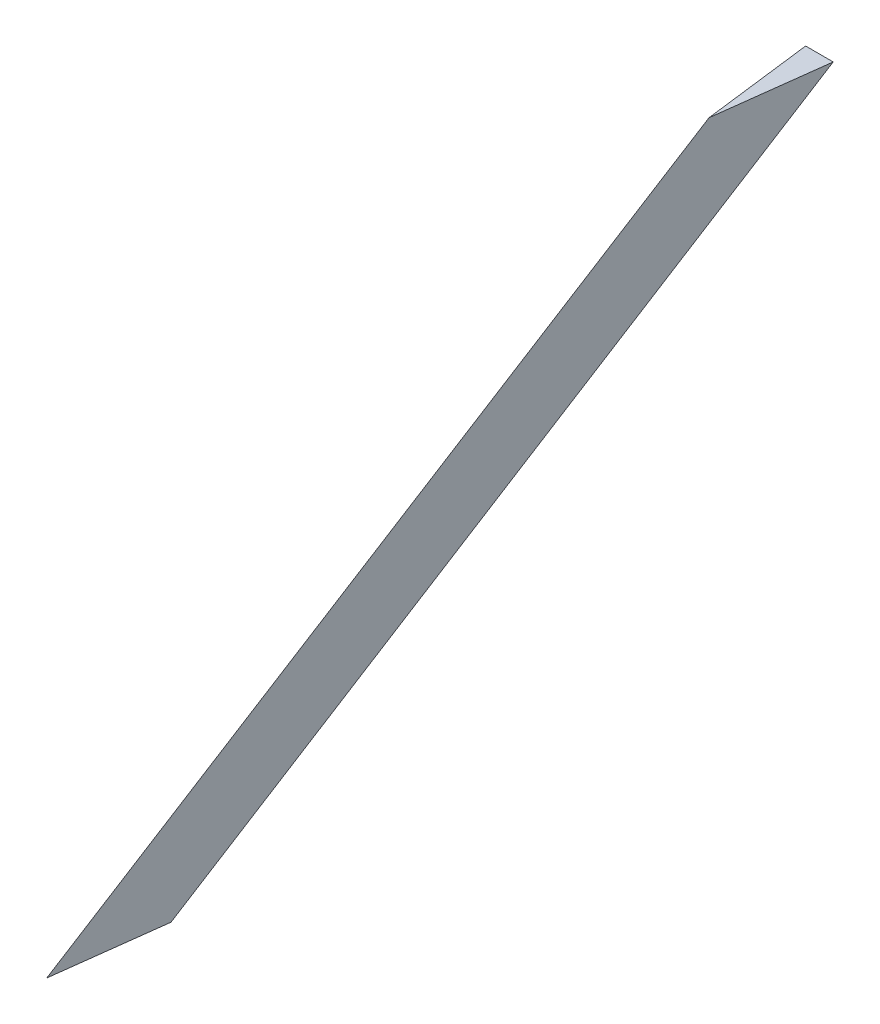
ISO-10303-21;
HEADER;
FILE_DESCRIPTION(('STEP AP214'),'2;1');
FILE_NAME('part.step','',(''),(''),'','','');
FILE_SCHEMA(('AUTOMOTIVE_DESIGN { 1 0 10303 214 1 1 1 1 }'));
ENDSEC;
DATA;
#1=APPLICATION_CONTEXT('core data for automotive mechanical design processes');
#2=APPLICATION_PROTOCOL_DEFINITION('international standard','automotive_design',2000,#1);
#3=PRODUCT_CONTEXT('',#1,'mechanical');
#4=PRODUCT('Part','Part','',(#3));
#5=PRODUCT_RELATED_PRODUCT_CATEGORY('part','',(#4));
#6=PRODUCT_DEFINITION_FORMATION('','',#4);
#7=PRODUCT_DEFINITION_CONTEXT('part definition',#1,'design');
#8=PRODUCT_DEFINITION('design','',#6,#7);
#9=PRODUCT_DEFINITION_SHAPE('','',#8);
#10=(LENGTH_UNIT() NAMED_UNIT(*) SI_UNIT(.MILLI.,.METRE.));
#11=(NAMED_UNIT(*) PLANE_ANGLE_UNIT() SI_UNIT($,.RADIAN.));
#12=(NAMED_UNIT(*) SI_UNIT($,.STERADIAN.) SOLID_ANGLE_UNIT());
#13=UNCERTAINTY_MEASURE_WITH_UNIT(LENGTH_MEASURE(1.E-05),#10,'distance_accuracy_value','');
#14=(GEOMETRIC_REPRESENTATION_CONTEXT(3) GLOBAL_UNCERTAINTY_ASSIGNED_CONTEXT((#13)) GLOBAL_UNIT_ASSIGNED_CONTEXT((#10,
#11,#12)) REPRESENTATION_CONTEXT('',''));
#15=CARTESIAN_POINT('',(0.,0.,0.));
#16=DIRECTION('',(0.,0.,1.));
#17=DIRECTION('',(1.,0.,0.));
#18=AXIS2_PLACEMENT_3D('',#15,#16,#17);
#19=CARTESIAN_POINT('',(0.,0.,0.));
#20=DIRECTION('',(0.,1.,0.));
#21=DIRECTION('',(0.,0.,1.));
#22=AXIS2_PLACEMENT_3D('',#19,#20,#21);
#23=PLANE('',#22);
#24=DIRECTION('',(0.124034734589208,0.,-0.992277876713668));
#25=VECTOR('',#24,1.);
#26=CARTESIAN_POINT('',(3.175,0.,0.));
#27=LINE('',#26,#25);
#28=CARTESIAN_POINT('',(0.,0.,25.4));
#29=VERTEX_POINT('',#28);
#30=CARTESIAN_POINT('',(3.175,0.,0.));
#31=VERTEX_POINT('',#30);
#32=EDGE_CURVE('E64',#29,#31,#27,.T.);
#33=ORIENTED_EDGE('',*,*,#32,.F.);
#34=DIRECTION('',(0.124034734589208,0.,0.992277876713668));
#35=VECTOR('',#34,1.);
#36=CARTESIAN_POINT('',(0.,0.,25.4));
#37=LINE('',#36,#35);
#38=CARTESIAN_POINT('',(-3.175,0.,0.));
#39=VERTEX_POINT('',#38);
#40=EDGE_CURVE('E67',#39,#29,#37,.T.);
#41=ORIENTED_EDGE('',*,*,#40,.F.);
#42=DIRECTION('',(-1.,0.,0.));
#43=VECTOR('',#42,1.);
#44=CARTESIAN_POINT('',(-3.175,0.,0.));
#45=LINE('',#44,#43);
#46=EDGE_CURVE('E61',#31,#39,#45,.T.);
#47=ORIENTED_EDGE('',*,*,#46,.F.);
#48=EDGE_LOOP('',(#33,#41,#47));
#49=FACE_BOUND('',#48,.T.);
#50=ADVANCED_FACE('F33',(#49),#23,.F.);
#51=CARTESIAN_POINT('',(0.,95.25,-152.4));
#52=DIRECTION('',(0.,1.,0.));
#53=DIRECTION('',(0.,0.,1.));
#54=AXIS2_PLACEMENT_3D('',#51,#52,#53);
#55=PLANE('',#54);
#56=DIRECTION('',(0.124034734589208,0.,-0.992277876713668));
#57=VECTOR('',#56,1.);
#58=CARTESIAN_POINT('',(3.175,95.25,-152.4));
#59=LINE('',#58,#57);
#60=CARTESIAN_POINT('',(0.,95.25,-127.));
#61=VERTEX_POINT('',#60);
#62=CARTESIAN_POINT('',(3.175,95.25,-152.4));
#63=VERTEX_POINT('',#62);
#64=EDGE_CURVE('E46',#61,#63,#59,.T.);
#65=ORIENTED_EDGE('',*,*,#64,.T.);
#66=DIRECTION('',(-1.,0.,0.));
#67=VECTOR('',#66,1.);
#68=CARTESIAN_POINT('',(-3.175,95.25,-152.4));
#69=LINE('',#68,#67);
#70=CARTESIAN_POINT('',(-3.175,95.25,-152.4));
#71=VERTEX_POINT('',#70);
#72=EDGE_CURVE('E11',#63,#71,#69,.T.);
#73=ORIENTED_EDGE('',*,*,#72,.T.);
#74=DIRECTION('',(0.124034734589208,0.,0.992277876713668));
#75=VECTOR('',#74,1.);
#76=CARTESIAN_POINT('',(0.,95.25,-127.));
#77=LINE('',#76,#75);
#78=EDGE_CURVE('E51',#71,#61,#77,.T.);
#79=ORIENTED_EDGE('',*,*,#78,.T.);
#80=EDGE_LOOP('',(#65,#73,#79));
#81=FACE_BOUND('',#80,.T.);
#82=ADVANCED_FACE('F96',(#81),#55,.T.);
#83=CARTESIAN_POINT('',(0.,0.,25.4));
#84=DIRECTION('',(-0.973296510978544,0.194659302195709,0.121662063872318));
#85=DIRECTION('',(-0.196116135138184,-0.98058067569092,0.));
#86=AXIS2_PLACEMENT_3D('',#83,#84,#85);
#87=PLANE('',#86);
#88=DIRECTION('',(0.,0.52999894000318,-0.847998304005088));
#89=VECTOR('',#88,1.);
#90=CARTESIAN_POINT('',(0.,0.,25.4));
#91=LINE('',#90,#89);
#92=EDGE_CURVE('E81',#29,#61,#91,.T.);
#93=ORIENTED_EDGE('',*,*,#92,.T.);
#94=ORIENTED_EDGE('',*,*,#78,.F.);
#95=DIRECTION('',(0.,0.52999894000318,-0.847998304005088));
#96=VECTOR('',#95,1.);
#97=CARTESIAN_POINT('',(-3.175,0.,0.));
#98=LINE('',#97,#96);
#99=EDGE_CURVE('E77',#39,#71,#98,.T.);
#100=ORIENTED_EDGE('',*,*,#99,.F.);
#101=ORIENTED_EDGE('',*,*,#40,.T.);
#102=EDGE_LOOP('',(#93,#94,#100,#101));
#103=FACE_BOUND('',#102,.T.);
#104=ADVANCED_FACE('F79',(#103),#87,.T.);
#105=CARTESIAN_POINT('',(3.175,0.,0.));
#106=DIRECTION('',(0.973296510978544,0.194659302195709,0.121662063872318));
#107=DIRECTION('',(-0.196116135138184,0.98058067569092,0.));
#108=AXIS2_PLACEMENT_3D('',#105,#106,#107);
#109=PLANE('',#108);
#110=DIRECTION('',(0.,0.52999894000318,-0.847998304005088));
#111=VECTOR('',#110,1.);
#112=CARTESIAN_POINT('',(3.175,0.,0.));
#113=LINE('',#112,#111);
#114=EDGE_CURVE('E40',#31,#63,#113,.T.);
#115=ORIENTED_EDGE('',*,*,#114,.T.);
#116=ORIENTED_EDGE('',*,*,#64,.F.);
#117=ORIENTED_EDGE('',*,*,#92,.F.);
#118=ORIENTED_EDGE('',*,*,#32,.T.);
#119=EDGE_LOOP('',(#115,#116,#117,#118));
#120=FACE_BOUND('',#119,.T.);
#121=ADVANCED_FACE('F88',(#120),#109,.T.);
#122=CARTESIAN_POINT('',(-3.175,0.,0.));
#123=DIRECTION('',(0.,-0.847998304005088,-0.52999894000318));
#124=DIRECTION('',(0.,0.52999894000318,-0.847998304005088));
#125=AXIS2_PLACEMENT_3D('',#122,#123,#124);
#126=PLANE('',#125);
#127=ORIENTED_EDGE('',*,*,#72,.F.);
#128=ORIENTED_EDGE('',*,*,#114,.F.);
#129=ORIENTED_EDGE('',*,*,#46,.T.);
#130=ORIENTED_EDGE('',*,*,#99,.T.);
#131=EDGE_LOOP('',(#127,#128,#129,#130));
#132=FACE_BOUND('',#131,.T.);
#133=ADVANCED_FACE('F76',(#132),#126,.T.);
#134=CLOSED_SHELL('',(#50,#82,#104,#121,#133));
#135=MANIFOLD_SOLID_BREP('B2',#134);
#136=ADVANCED_BREP_SHAPE_REPRESENTATION('',(#18,#135),#14);
#137=SHAPE_DEFINITION_REPRESENTATION(#9,#136);
ENDSEC;
END-ISO-10303-21;
